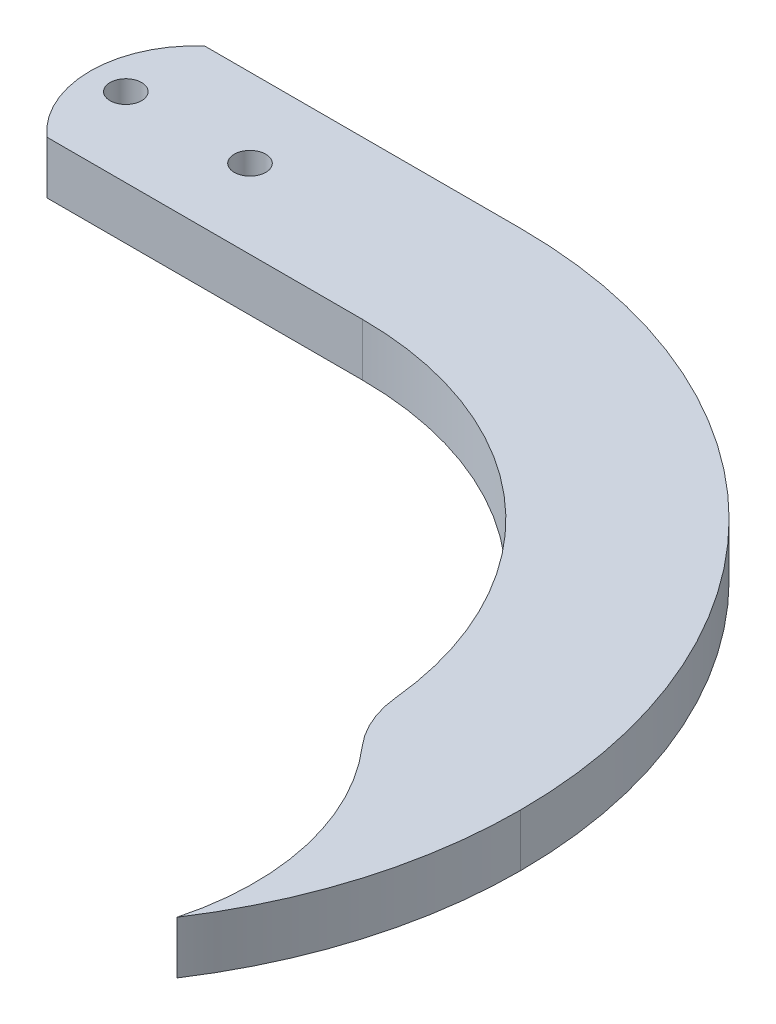
ISO-10303-21;
HEADER;
FILE_DESCRIPTION(('STEP AP214'),'2;1');
FILE_NAME('part.step','',(''),(''),'','','');
FILE_SCHEMA(('AUTOMOTIVE_DESIGN { 1 0 10303 214 1 1 1 1 }'));
ENDSEC;
DATA;
#1=APPLICATION_CONTEXT('core data for automotive mechanical design processes');
#2=APPLICATION_PROTOCOL_DEFINITION('international standard','automotive_design',2000,#1);
#3=PRODUCT_CONTEXT('',#1,'mechanical');
#4=PRODUCT('Part','Part','',(#3));
#5=PRODUCT_RELATED_PRODUCT_CATEGORY('part','',(#4));
#6=PRODUCT_DEFINITION_FORMATION('','',#4);
#7=PRODUCT_DEFINITION_CONTEXT('part definition',#1,'design');
#8=PRODUCT_DEFINITION('design','',#6,#7);
#9=PRODUCT_DEFINITION_SHAPE('','',#8);
#10=(LENGTH_UNIT() NAMED_UNIT(*) SI_UNIT(.MILLI.,.METRE.));
#11=(NAMED_UNIT(*) PLANE_ANGLE_UNIT() SI_UNIT($,.RADIAN.));
#12=(NAMED_UNIT(*) SI_UNIT($,.STERADIAN.) SOLID_ANGLE_UNIT());
#13=UNCERTAINTY_MEASURE_WITH_UNIT(LENGTH_MEASURE(1.E-05),#10,'distance_accuracy_value','');
#14=(GEOMETRIC_REPRESENTATION_CONTEXT(3) GLOBAL_UNCERTAINTY_ASSIGNED_CONTEXT((#13)) GLOBAL_UNIT_ASSIGNED_CONTEXT((#10,
#11,#12)) REPRESENTATION_CONTEXT('',''));
#15=CARTESIAN_POINT('',(0.,0.,0.));
#16=DIRECTION('',(0.,0.,1.));
#17=DIRECTION('',(1.,0.,0.));
#18=AXIS2_PLACEMENT_3D('',#15,#16,#17);
#19=CARTESIAN_POINT('',(0.,5.,0.));
#20=DIRECTION('',(0.,1.,0.));
#21=DIRECTION('',(0.,0.,1.));
#22=AXIS2_PLACEMENT_3D('',#19,#20,#21);
#23=PLANE('',#22);
#24=CARTESIAN_POINT('',(30.,5.,40.375));
#25=DIRECTION('',(0.,1.,0.));
#26=DIRECTION('',(0.,0.,1.));
#27=AXIS2_PLACEMENT_3D('',#24,#25,#26);
#28=CIRCLE('',#27,32.875);
#29=CARTESIAN_POINT('',(62.7098407903248,5.,37.0838086546663));
#30=VERTEX_POINT('',#29);
#31=CARTESIAN_POINT('',(30.,5.,7.5));
#32=VERTEX_POINT('',#31);
#33=EDGE_CURVE('E144',#30,#32,#28,.T.);
#34=ORIENTED_EDGE('',*,*,#33,.F.);
#35=CARTESIAN_POINT('',(72.6596022474579,5.,36.0826858119792));
#36=DIRECTION('',(0.,1.,0.));
#37=DIRECTION('',(0.,0.,1.));
#38=AXIS2_PLACEMENT_3D('',#35,#36,#37);
#39=CIRCLE('',#38,10.);
#40=CARTESIAN_POINT('',(65.1088411432145,5.,42.6390572738966));
#41=VERTEX_POINT('',#40);
#42=EDGE_CURVE('E12',#30,#41,#39,.T.);
#43=ORIENTED_EDGE('',*,*,#42,.T.);
#44=CARTESIAN_POINT('',(46.231938382606,5.,59.0299859286902));
#45=DIRECTION('',(0.,1.,0.));
#46=DIRECTION('',(0.,0.,1.));
#47=AXIS2_PLACEMENT_3D('',#44,#45,#46);
#48=CIRCLE('',#47,25.);
#49=CARTESIAN_POINT('',(70.375,5.,65.5194062216531));
#50=VERTEX_POINT('',#49);
#51=EDGE_CURVE('E104',#41,#50,#48,.F.);
#52=ORIENTED_EDGE('',*,*,#51,.T.);
#53=CARTESIAN_POINT('',(31.975589050699,5.,40.375));
#54=DIRECTION('',(0.,1.,0.));
#55=DIRECTION('',(0.,0.,1.));
#56=AXIS2_PLACEMENT_3D('',#53,#54,#55);
#57=CIRCLE('',#56,45.8994109493009);
#58=CARTESIAN_POINT('',(77.875,5.,40.375));
#59=VERTEX_POINT('',#58);
#60=EDGE_CURVE('E108',#59,#50,#57,.F.);
#61=ORIENTED_EDGE('',*,*,#60,.F.);
#62=CARTESIAN_POINT('',(30.,5.,40.375));
#63=DIRECTION('',(0.,1.,0.));
#64=DIRECTION('',(0.,0.,1.));
#65=AXIS2_PLACEMENT_3D('',#62,#63,#64);
#66=CIRCLE('',#65,47.875);
#67=CARTESIAN_POINT('',(30.,5.,-7.5));
#68=VERTEX_POINT('',#67);
#69=EDGE_CURVE('E146',#59,#68,#66,.T.);
#70=ORIENTED_EDGE('',*,*,#69,.T.);
#71=DIRECTION('',(1.,0.,0.));
#72=VECTOR('',#71,1.);
#73=CARTESIAN_POINT('',(0.,5.,-7.5));
#74=LINE('',#73,#72);
#75=CARTESIAN_POINT('',(0.,5.,-7.5));
#76=VERTEX_POINT('',#75);
#77=EDGE_CURVE('E148',#76,#68,#74,.T.);
#78=ORIENTED_EDGE('',*,*,#77,.F.);
#79=CARTESIAN_POINT('',(6.61437827766148,5.,0.));
#80=DIRECTION('',(0.,1.,0.));
#81=DIRECTION('',(0.,0.,1.));
#82=AXIS2_PLACEMENT_3D('',#79,#80,#81);
#83=CIRCLE('',#82,10.);
#84=CARTESIAN_POINT('',(0.,5.,7.5));
#85=VERTEX_POINT('',#84);
#86=EDGE_CURVE('E130',#76,#85,#83,.T.);
#87=ORIENTED_EDGE('',*,*,#86,.T.);
#88=DIRECTION('',(1.,0.,0.));
#89=VECTOR('',#88,1.);
#90=CARTESIAN_POINT('',(0.,5.,7.5));
#91=LINE('',#90,#89);
#92=EDGE_CURVE('E141',#85,#32,#91,.T.);
#93=ORIENTED_EDGE('',*,*,#92,.T.);
#94=EDGE_LOOP('',(#34,#43,#52,#61,#70,#78,#87,#93));
#95=FACE_BOUND('',#94,.T.);
#96=CARTESIAN_POINT('',(11.8,5.,0.));
#97=DIRECTION('',(0.,1.,0.));
#98=DIRECTION('',(0.,0.,1.));
#99=AXIS2_PLACEMENT_3D('',#96,#97,#98);
#100=CIRCLE('',#99,1.5);
#101=CARTESIAN_POINT('',(11.8,5.,1.5));
#102=VERTEX_POINT('',#101);
#103=EDGE_CURVE('E134',#102,#102,#100,.T.);
#104=ORIENTED_EDGE('',*,*,#103,.F.);
#105=EDGE_LOOP('',(#104));
#106=FACE_BOUND('',#105,.T.);
#107=CARTESIAN_POINT('',(0.,5.,0.));
#108=DIRECTION('',(0.,1.,0.));
#109=DIRECTION('',(0.,0.,1.));
#110=AXIS2_PLACEMENT_3D('',#107,#108,#109);
#111=CIRCLE('',#110,1.5);
#112=CARTESIAN_POINT('',(0.,5.,1.5));
#113=VERTEX_POINT('',#112);
#114=EDGE_CURVE('E137',#113,#113,#111,.T.);
#115=ORIENTED_EDGE('',*,*,#114,.F.);
#116=EDGE_LOOP('',(#115));
#117=FACE_BOUND('',#116,.T.);
#118=ADVANCED_FACE('F41',(#95,#106,#117),#23,.T.);
#119=CARTESIAN_POINT('',(0.,0.,0.));
#120=DIRECTION('',(0.,1.,0.));
#121=DIRECTION('',(0.,0.,1.));
#122=AXIS2_PLACEMENT_3D('',#119,#120,#121);
#123=PLANE('',#122);
#124=CARTESIAN_POINT('',(0.,0.,0.));
#125=DIRECTION('',(0.,1.,0.));
#126=DIRECTION('',(0.,0.,1.));
#127=AXIS2_PLACEMENT_3D('',#124,#125,#126);
#128=CIRCLE('',#127,1.5);
#129=CARTESIAN_POINT('',(0.,0.,1.5));
#130=VERTEX_POINT('',#129);
#131=EDGE_CURVE('E154',#130,#130,#128,.T.);
#132=ORIENTED_EDGE('',*,*,#131,.T.);
#133=EDGE_LOOP('',(#132));
#134=FACE_BOUND('',#133,.T.);
#135=CARTESIAN_POINT('',(11.8,0.,0.));
#136=DIRECTION('',(0.,1.,0.));
#137=DIRECTION('',(0.,0.,1.));
#138=AXIS2_PLACEMENT_3D('',#135,#136,#137);
#139=CIRCLE('',#138,1.5);
#140=CARTESIAN_POINT('',(11.8,0.,1.5));
#141=VERTEX_POINT('',#140);
#142=EDGE_CURVE('E133',#141,#141,#139,.T.);
#143=ORIENTED_EDGE('',*,*,#142,.T.);
#144=EDGE_LOOP('',(#143));
#145=FACE_BOUND('',#144,.T.);
#146=CARTESIAN_POINT('',(46.231938382606,0.,59.0299859286902));
#147=DIRECTION('',(0.,1.,0.));
#148=DIRECTION('',(0.,0.,1.));
#149=AXIS2_PLACEMENT_3D('',#146,#147,#148);
#150=CIRCLE('',#149,25.);
#151=CARTESIAN_POINT('',(70.375,0.,65.5194062216531));
#152=VERTEX_POINT('',#151);
#153=CARTESIAN_POINT('',(65.1088411432145,0.,42.6390572738966));
#154=VERTEX_POINT('',#153);
#155=EDGE_CURVE('E119',#152,#154,#150,.T.);
#156=ORIENTED_EDGE('',*,*,#155,.T.);
#157=CARTESIAN_POINT('',(72.6596022474579,0.,36.0826858119792));
#158=DIRECTION('',(0.,1.,0.));
#159=DIRECTION('',(0.,0.,1.));
#160=AXIS2_PLACEMENT_3D('',#157,#158,#159);
#161=CIRCLE('',#160,10.);
#162=CARTESIAN_POINT('',(62.7098407903248,0.,37.0838086546663));
#163=VERTEX_POINT('',#162);
#164=EDGE_CURVE('E63',#154,#163,#161,.F.);
#165=ORIENTED_EDGE('',*,*,#164,.T.);
#166=CARTESIAN_POINT('',(30.,0.,40.375));
#167=DIRECTION('',(0.,1.,0.));
#168=DIRECTION('',(0.,0.,1.));
#169=AXIS2_PLACEMENT_3D('',#166,#167,#168);
#170=CIRCLE('',#169,32.875);
#171=CARTESIAN_POINT('',(30.,0.,7.5));
#172=VERTEX_POINT('',#171);
#173=EDGE_CURVE('E160',#163,#172,#170,.T.);
#174=ORIENTED_EDGE('',*,*,#173,.T.);
#175=DIRECTION('',(1.,0.,0.));
#176=VECTOR('',#175,1.);
#177=CARTESIAN_POINT('',(0.,0.,7.5));
#178=LINE('',#177,#176);
#179=CARTESIAN_POINT('',(0.,0.,7.5));
#180=VERTEX_POINT('',#179);
#181=EDGE_CURVE('E157',#180,#172,#178,.T.);
#182=ORIENTED_EDGE('',*,*,#181,.F.);
#183=CARTESIAN_POINT('',(6.61437827766148,0.,0.));
#184=DIRECTION('',(0.,1.,0.));
#185=DIRECTION('',(0.,0.,1.));
#186=AXIS2_PLACEMENT_3D('',#183,#184,#185);
#187=CIRCLE('',#186,10.);
#188=CARTESIAN_POINT('',(0.,0.,-7.5));
#189=VERTEX_POINT('',#188);
#190=EDGE_CURVE('E177',#189,#180,#187,.T.);
#191=ORIENTED_EDGE('',*,*,#190,.F.);
#192=DIRECTION('',(1.,0.,0.));
#193=VECTOR('',#192,1.);
#194=CARTESIAN_POINT('',(0.,0.,-7.5));
#195=LINE('',#194,#193);
#196=CARTESIAN_POINT('',(30.,0.,-7.5));
#197=VERTEX_POINT('',#196);
#198=EDGE_CURVE('E138',#189,#197,#195,.T.);
#199=ORIENTED_EDGE('',*,*,#198,.T.);
#200=CARTESIAN_POINT('',(30.,0.,40.375));
#201=DIRECTION('',(0.,1.,0.));
#202=DIRECTION('',(0.,0.,1.));
#203=AXIS2_PLACEMENT_3D('',#200,#201,#202);
#204=CIRCLE('',#203,47.875);
#205=CARTESIAN_POINT('',(77.875,0.,40.375));
#206=VERTEX_POINT('',#205);
#207=EDGE_CURVE('E162',#206,#197,#204,.T.);
#208=ORIENTED_EDGE('',*,*,#207,.F.);
#209=CARTESIAN_POINT('',(31.975589050699,0.,40.375));
#210=DIRECTION('',(0.,1.,0.));
#211=DIRECTION('',(0.,0.,1.));
#212=AXIS2_PLACEMENT_3D('',#209,#210,#211);
#213=CIRCLE('',#212,45.8994109493009);
#214=EDGE_CURVE('E121',#152,#206,#213,.T.);
#215=ORIENTED_EDGE('',*,*,#214,.F.);
#216=EDGE_LOOP('',(#156,#165,#174,#182,#191,#199,#208,#215));
#217=FACE_BOUND('',#216,.T.);
#218=ADVANCED_FACE('F182',(#134,#145,#217),#123,.F.);
#219=CARTESIAN_POINT('',(0.,5.,7.5));
#220=DIRECTION('',(0.,0.,-1.));
#221=DIRECTION('',(-1.,0.,0.));
#222=AXIS2_PLACEMENT_3D('',#219,#220,#221);
#223=PLANE('',#222);
#224=ORIENTED_EDGE('',*,*,#181,.T.);
#225=DIRECTION('',(0.,-1.,0.));
#226=VECTOR('',#225,1.);
#227=CARTESIAN_POINT('',(30.,5.,7.5));
#228=LINE('',#227,#226);
#229=EDGE_CURVE('E174',#32,#172,#228,.T.);
#230=ORIENTED_EDGE('',*,*,#229,.F.);
#231=ORIENTED_EDGE('',*,*,#92,.F.);
#232=DIRECTION('',(0.,-1.,0.));
#233=VECTOR('',#232,1.);
#234=CARTESIAN_POINT('',(0.,5.,7.5));
#235=LINE('',#234,#233);
#236=EDGE_CURVE('E151',#85,#180,#235,.T.);
#237=ORIENTED_EDGE('',*,*,#236,.T.);
#238=EDGE_LOOP('',(#224,#230,#231,#237));
#239=FACE_BOUND('',#238,.T.);
#240=ADVANCED_FACE('F199',(#239),#223,.F.);
#241=CARTESIAN_POINT('',(30.,5.,40.375));
#242=DIRECTION('',(0.,-1.,0.));
#243=DIRECTION('',(0.,0.,-1.));
#244=AXIS2_PLACEMENT_3D('',#241,#242,#243);
#245=CYLINDRICAL_SURFACE('',#244,32.875);
#246=ORIENTED_EDGE('',*,*,#173,.F.);
#247=DIRECTION('',(0.,-1.,0.));
#248=VECTOR('',#247,1.);
#249=CARTESIAN_POINT('',(62.7098407903248,5.,37.0838086546663));
#250=LINE('',#249,#248);
#251=EDGE_CURVE('E49',#163,#30,#250,.F.);
#252=ORIENTED_EDGE('',*,*,#251,.T.);
#253=ORIENTED_EDGE('',*,*,#33,.T.);
#254=ORIENTED_EDGE('',*,*,#229,.T.);
#255=EDGE_LOOP('',(#246,#252,#253,#254));
#256=FACE_BOUND('',#255,.T.);
#257=ADVANCED_FACE('F219',(#256),#245,.F.);
#258=CARTESIAN_POINT('',(30.,5.,40.375));
#259=DIRECTION('',(0.,-1.,0.));
#260=DIRECTION('',(0.,0.,-1.));
#261=AXIS2_PLACEMENT_3D('',#258,#259,#260);
#262=CYLINDRICAL_SURFACE('',#261,47.875);
#263=ORIENTED_EDGE('',*,*,#207,.T.);
#264=DIRECTION('',(0.,-1.,0.));
#265=VECTOR('',#264,1.);
#266=CARTESIAN_POINT('',(30.,5.,-7.5));
#267=LINE('',#266,#265);
#268=EDGE_CURVE('E171',#68,#197,#267,.T.);
#269=ORIENTED_EDGE('',*,*,#268,.F.);
#270=ORIENTED_EDGE('',*,*,#69,.F.);
#271=DIRECTION('',(0.,-1.,0.));
#272=VECTOR('',#271,1.);
#273=CARTESIAN_POINT('',(77.875,5.,40.375));
#274=LINE('',#273,#272);
#275=EDGE_CURVE('E125',#59,#206,#274,.T.);
#276=ORIENTED_EDGE('',*,*,#275,.T.);
#277=EDGE_LOOP('',(#263,#269,#270,#276));
#278=FACE_BOUND('',#277,.T.);
#279=ADVANCED_FACE('F185',(#278),#262,.T.);
#280=CARTESIAN_POINT('',(0.,5.,-7.5));
#281=DIRECTION('',(0.,0.,-1.));
#282=DIRECTION('',(-1.,0.,0.));
#283=AXIS2_PLACEMENT_3D('',#280,#281,#282);
#284=PLANE('',#283);
#285=ORIENTED_EDGE('',*,*,#198,.F.);
#286=DIRECTION('',(0.,-1.,0.));
#287=VECTOR('',#286,1.);
#288=CARTESIAN_POINT('',(0.,5.,-7.5));
#289=LINE('',#288,#287);
#290=EDGE_CURVE('E169',#76,#189,#289,.T.);
#291=ORIENTED_EDGE('',*,*,#290,.F.);
#292=ORIENTED_EDGE('',*,*,#77,.T.);
#293=ORIENTED_EDGE('',*,*,#268,.T.);
#294=EDGE_LOOP('',(#285,#291,#292,#293));
#295=FACE_BOUND('',#294,.T.);
#296=ADVANCED_FACE('F192',(#295),#284,.T.);
#297=CARTESIAN_POINT('',(0.,5.,0.));
#298=DIRECTION('',(0.,-1.,0.));
#299=DIRECTION('',(0.,0.,-1.));
#300=AXIS2_PLACEMENT_3D('',#297,#298,#299);
#301=CYLINDRICAL_SURFACE('',#300,1.5);
#302=ORIENTED_EDGE('',*,*,#114,.T.);
#303=EDGE_LOOP('',(#302));
#304=FACE_BOUND('',#303,.T.);
#305=ORIENTED_EDGE('',*,*,#131,.F.);
#306=EDGE_LOOP('',(#305));
#307=FACE_BOUND('',#306,.T.);
#308=ADVANCED_FACE('F216',(#304,#307),#301,.F.);
#309=CARTESIAN_POINT('',(11.8,5.,0.));
#310=DIRECTION('',(0.,-1.,0.));
#311=DIRECTION('',(0.,0.,-1.));
#312=AXIS2_PLACEMENT_3D('',#309,#310,#311);
#313=CYLINDRICAL_SURFACE('',#312,1.5);
#314=ORIENTED_EDGE('',*,*,#103,.T.);
#315=EDGE_LOOP('',(#314));
#316=FACE_BOUND('',#315,.T.);
#317=ORIENTED_EDGE('',*,*,#142,.F.);
#318=EDGE_LOOP('',(#317));
#319=FACE_BOUND('',#318,.T.);
#320=ADVANCED_FACE('F225',(#316,#319),#313,.F.);
#321=CARTESIAN_POINT('',(6.61437827766148,-5.,0.));
#322=DIRECTION('',(0.,1.,0.));
#323=DIRECTION('',(0.,0.,1.));
#324=AXIS2_PLACEMENT_3D('',#321,#322,#323);
#325=CYLINDRICAL_SURFACE('',#324,10.);
#326=ORIENTED_EDGE('',*,*,#190,.T.);
#327=ORIENTED_EDGE('',*,*,#236,.F.);
#328=ORIENTED_EDGE('',*,*,#86,.F.);
#329=ORIENTED_EDGE('',*,*,#290,.T.);
#330=EDGE_LOOP('',(#326,#327,#328,#329));
#331=FACE_BOUND('',#330,.T.);
#332=ADVANCED_FACE('F195',(#331),#325,.T.);
#333=CARTESIAN_POINT('',(31.975589050699,-26.8413417200407,40.375));
#334=DIRECTION('',(0.,1.,0.));
#335=DIRECTION('',(0.,0.,1.));
#336=AXIS2_PLACEMENT_3D('',#333,#334,#335);
#337=CYLINDRICAL_SURFACE('',#336,45.8994109493009);
#338=DIRECTION('',(0.,1.,0.));
#339=VECTOR('',#338,1.);
#340=CARTESIAN_POINT('',(70.375,-26.8413417200407,65.5194062216531));
#341=LINE('',#340,#339);
#342=EDGE_CURVE('E117',#152,#50,#341,.T.);
#343=ORIENTED_EDGE('',*,*,#342,.F.);
#344=ORIENTED_EDGE('',*,*,#214,.T.);
#345=ORIENTED_EDGE('',*,*,#275,.F.);
#346=ORIENTED_EDGE('',*,*,#60,.T.);
#347=EDGE_LOOP('',(#343,#344,#345,#346));
#348=FACE_BOUND('',#347,.T.);
#349=ADVANCED_FACE('F123',(#348),#337,.T.);
#350=CARTESIAN_POINT('',(46.231938382606,-26.8413417200407,59.0299859286902));
#351=DIRECTION('',(0.,1.,0.));
#352=DIRECTION('',(0.,0.,1.));
#353=AXIS2_PLACEMENT_3D('',#350,#351,#352);
#354=CYLINDRICAL_SURFACE('',#353,25.);
#355=ORIENTED_EDGE('',*,*,#51,.F.);
#356=DIRECTION('',(0.,1.,0.));
#357=VECTOR('',#356,1.);
#358=CARTESIAN_POINT('',(65.1088411432145,-26.8413417200407,42.6390572738966));
#359=LINE('',#358,#357);
#360=EDGE_CURVE('E179',#41,#154,#359,.F.);
#361=ORIENTED_EDGE('',*,*,#360,.T.);
#362=ORIENTED_EDGE('',*,*,#155,.F.);
#363=ORIENTED_EDGE('',*,*,#342,.T.);
#364=EDGE_LOOP('',(#355,#361,#362,#363));
#365=FACE_BOUND('',#364,.T.);
#366=ADVANCED_FACE('F118',(#365),#354,.F.);
#367=CARTESIAN_POINT('',(72.6596022474579,5.,36.0826858119792));
#368=DIRECTION('',(0.,-1.,0.));
#369=DIRECTION('',(0.,0.,-1.));
#370=AXIS2_PLACEMENT_3D('',#367,#368,#369);
#371=CYLINDRICAL_SURFACE('',#370,10.);
#372=ORIENTED_EDGE('',*,*,#42,.F.);
#373=ORIENTED_EDGE('',*,*,#251,.F.);
#374=ORIENTED_EDGE('',*,*,#164,.F.);
#375=ORIENTED_EDGE('',*,*,#360,.F.);
#376=EDGE_LOOP('',(#372,#373,#374,#375));
#377=FACE_BOUND('',#376,.T.);
#378=ADVANCED_FACE('F43',(#377),#371,.T.);
#379=CLOSED_SHELL('',(#118,#218,#240,#257,#279,#296,#308,#320,#332,#349,#366,#378));
#380=MANIFOLD_SOLID_BREP('B2',#379);
#381=ADVANCED_BREP_SHAPE_REPRESENTATION('',(#18,#380),#14);
#382=SHAPE_DEFINITION_REPRESENTATION(#9,#381);
ENDSEC;
END-ISO-10303-21;
